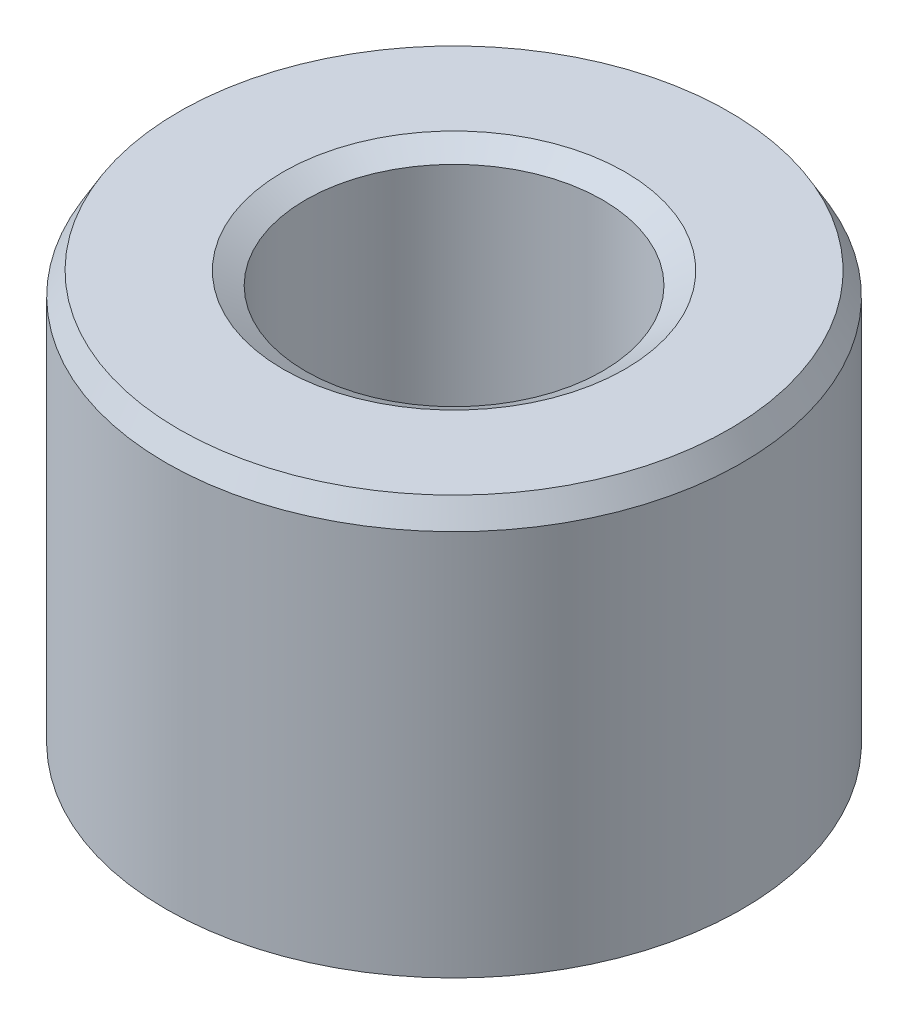
ISO-10303-21;
HEADER;
FILE_DESCRIPTION(('STEP AP214'),'2;1');
FILE_NAME('part.step','',(''),(''),'','','');
FILE_SCHEMA(('AUTOMOTIVE_DESIGN { 1 0 10303 214 1 1 1 1 }'));
ENDSEC;
DATA;
#1=APPLICATION_CONTEXT('core data for automotive mechanical design processes');
#2=APPLICATION_PROTOCOL_DEFINITION('international standard','automotive_design',2000,#1);
#3=PRODUCT_CONTEXT('',#1,'mechanical');
#4=PRODUCT('Part','Part','',(#3));
#5=PRODUCT_RELATED_PRODUCT_CATEGORY('part','',(#4));
#6=PRODUCT_DEFINITION_FORMATION('','',#4);
#7=PRODUCT_DEFINITION_CONTEXT('part definition',#1,'design');
#8=PRODUCT_DEFINITION('design','',#6,#7);
#9=PRODUCT_DEFINITION_SHAPE('','',#8);
#10=(LENGTH_UNIT() NAMED_UNIT(*) SI_UNIT(.MILLI.,.METRE.));
#11=(NAMED_UNIT(*) PLANE_ANGLE_UNIT() SI_UNIT($,.RADIAN.));
#12=(NAMED_UNIT(*) SI_UNIT($,.STERADIAN.) SOLID_ANGLE_UNIT());
#13=UNCERTAINTY_MEASURE_WITH_UNIT(LENGTH_MEASURE(1.E-05),#10,'distance_accuracy_value','');
#14=(GEOMETRIC_REPRESENTATION_CONTEXT(3) GLOBAL_UNCERTAINTY_ASSIGNED_CONTEXT((#13)) GLOBAL_UNIT_ASSIGNED_CONTEXT((#10,
#11,#12)) REPRESENTATION_CONTEXT('',''));
#15=CARTESIAN_POINT('',(0.,0.,0.));
#16=DIRECTION('',(0.,0.,1.));
#17=DIRECTION('',(1.,0.,0.));
#18=AXIS2_PLACEMENT_3D('',#15,#16,#17);
#19=CARTESIAN_POINT('',(0.,54.9305365331568,0.));
#20=DIRECTION('',(0.,-1.,0.));
#21=DIRECTION('',(0.,0.,-1.));
#22=AXIS2_PLACEMENT_3D('',#19,#20,#21);
#23=CYLINDRICAL_SURFACE('',#22,37.5);
#24=CARTESIAN_POINT('',(0.,1.68971337291047,0.));
#25=DIRECTION('',(0.,1.,0.));
#26=DIRECTION('',(0.,0.,1.));
#27=AXIS2_PLACEMENT_3D('',#24,#25,#26);
#28=CIRCLE('',#27,37.5);
#29=CARTESIAN_POINT('',(0.,1.68971337291047,37.5));
#30=VERTEX_POINT('',#29);
#31=EDGE_CURVE('E10',#30,#30,#28,.T.);
#32=ORIENTED_EDGE('',*,*,#31,.T.);
#33=EDGE_LOOP('',(#32));
#34=FACE_BOUND('',#33,.T.);
#35=CARTESIAN_POINT('',(0.,52.0038671210472,0.));
#36=DIRECTION('',(0.,1.,0.));
#37=DIRECTION('',(0.,0.,1.));
#38=AXIS2_PLACEMENT_3D('',#35,#36,#37);
#39=CIRCLE('',#38,37.5);
#40=CARTESIAN_POINT('',(0.,52.0038671210472,37.5));
#41=VERTEX_POINT('',#40);
#42=EDGE_CURVE('E50',#41,#41,#39,.F.);
#43=ORIENTED_EDGE('',*,*,#42,.T.);
#44=EDGE_LOOP('',(#43));
#45=FACE_BOUND('',#44,.T.);
#46=ADVANCED_FACE('F39',(#34,#45),#23,.T.);
#47=CARTESIAN_POINT('',(0.,54.9305365331568,0.));
#48=DIRECTION('',(0.,1.,0.));
#49=DIRECTION('',(0.,0.,1.));
#50=AXIS2_PLACEMENT_3D('',#47,#48,#49);
#51=PLANE('',#50);
#52=CARTESIAN_POINT('',(0.,54.9305365331568,0.));
#53=DIRECTION('',(0.,1.,0.));
#54=DIRECTION('',(0.,0.,1.));
#55=AXIS2_PLACEMENT_3D('',#52,#53,#54);
#56=CIRCLE('',#55,22.2498414124076);
#57=CARTESIAN_POINT('',(0.,54.9305365331568,22.2498414124076));
#58=VERTEX_POINT('',#57);
#59=EDGE_CURVE('E58',#58,#58,#56,.F.);
#60=ORIENTED_EDGE('',*,*,#59,.T.);
#61=EDGE_LOOP('',(#60));
#62=FACE_BOUND('',#61,.T.);
#63=CARTESIAN_POINT('',(0.,54.9305365331568,0.));
#64=DIRECTION('',(0.,1.,0.));
#65=DIRECTION('',(0.,0.,1.));
#66=AXIS2_PLACEMENT_3D('',#63,#64,#65);
#67=CIRCLE('',#66,35.8102866270895);
#68=CARTESIAN_POINT('',(0.,54.9305365331568,35.8102866270895));
#69=VERTEX_POINT('',#68);
#70=EDGE_CURVE('E61',#69,#69,#67,.T.);
#71=ORIENTED_EDGE('',*,*,#70,.T.);
#72=EDGE_LOOP('',(#71));
#73=FACE_BOUND('',#72,.T.);
#74=ADVANCED_FACE('F88',(#62,#73),#51,.T.);
#75=CARTESIAN_POINT('',(0.,0.,0.));
#76=DIRECTION('',(0.,1.,0.));
#77=DIRECTION('',(0.,0.,1.));
#78=AXIS2_PLACEMENT_3D('',#75,#76,#77);
#79=PLANE('',#78);
#80=CARTESIAN_POINT('',(0.,0.,0.));
#81=DIRECTION('',(0.,1.,0.));
#82=DIRECTION('',(0.,0.,1.));
#83=AXIS2_PLACEMENT_3D('',#80,#81,#82);
#84=CIRCLE('',#83,21.0128853732086);
#85=CARTESIAN_POINT('',(0.,0.,21.0128853732086));
#86=VERTEX_POINT('',#85);
#87=EDGE_CURVE('E51',#86,#86,#84,.T.);
#88=ORIENTED_EDGE('',*,*,#87,.T.);
#89=EDGE_LOOP('',(#88));
#90=FACE_BOUND('',#89,.T.);
#91=CARTESIAN_POINT('',(0.,0.,0.));
#92=DIRECTION('',(0.,1.,0.));
#93=DIRECTION('',(0.,0.,1.));
#94=AXIS2_PLACEMENT_3D('',#91,#92,#93);
#95=CIRCLE('',#94,34.5733305878905);
#96=CARTESIAN_POINT('',(0.,0.,34.5733305878905));
#97=VERTEX_POINT('',#96);
#98=EDGE_CURVE('E54',#97,#97,#95,.F.);
#99=ORIENTED_EDGE('',*,*,#98,.T.);
#100=EDGE_LOOP('',(#99));
#101=FACE_BOUND('',#100,.T.);
#102=ADVANCED_FACE('F83',(#90,#101),#79,.F.);
#103=CARTESIAN_POINT('',(0.,54.9305365331568,0.));
#104=DIRECTION('',(0.,-1.,0.));
#105=DIRECTION('',(0.,0.,-1.));
#106=AXIS2_PLACEMENT_3D('',#103,#104,#105);
#107=CYLINDRICAL_SURFACE('',#106,19.3231720002981);
#108=CARTESIAN_POINT('',(0.,53.2408231602463,0.));
#109=DIRECTION('',(0.,1.,0.));
#110=DIRECTION('',(0.,0.,1.));
#111=AXIS2_PLACEMENT_3D('',#108,#109,#110);
#112=CIRCLE('',#111,19.3231720002981);
#113=CARTESIAN_POINT('',(0.,53.2408231602463,19.3231720002981));
#114=VERTEX_POINT('',#113);
#115=EDGE_CURVE('E67',#114,#114,#112,.T.);
#116=ORIENTED_EDGE('',*,*,#115,.T.);
#117=EDGE_LOOP('',(#116));
#118=FACE_BOUND('',#117,.T.);
#119=CARTESIAN_POINT('',(0.,2.92666941210953,0.));
#120=DIRECTION('',(0.,1.,0.));
#121=DIRECTION('',(0.,0.,1.));
#122=AXIS2_PLACEMENT_3D('',#119,#120,#121);
#123=CIRCLE('',#122,19.3231720002981);
#124=CARTESIAN_POINT('',(0.,2.92666941210953,19.3231720002981));
#125=VERTEX_POINT('',#124);
#126=EDGE_CURVE('E69',#125,#125,#123,.F.);
#127=ORIENTED_EDGE('',*,*,#126,.T.);
#128=EDGE_LOOP('',(#127));
#129=FACE_BOUND('',#128,.T.);
#130=ADVANCED_FACE('F71',(#118,#129),#107,.F.);
#131=CARTESIAN_POINT('',(0.,53.2408231602463,0.));
#132=DIRECTION('',(0.,1.,0.));
#133=DIRECTION('',(0.,0.,1.));
#134=AXIS2_PLACEMENT_3D('',#131,#132,#133);
#135=CONICAL_SURFACE('',#134,19.3231720002981,1.0471975511966);
#136=ORIENTED_EDGE('',*,*,#59,.F.);
#137=EDGE_LOOP('',(#136));
#138=FACE_BOUND('',#137,.T.);
#139=ORIENTED_EDGE('',*,*,#115,.F.);
#140=EDGE_LOOP('',(#139));
#141=FACE_BOUND('',#140,.T.);
#142=ADVANCED_FACE('F77',(#138,#141),#135,.F.);
#143=CARTESIAN_POINT('',(0.,0.,0.));
#144=DIRECTION('',(0.,-1.,0.));
#145=DIRECTION('',(0.,0.,-1.));
#146=AXIS2_PLACEMENT_3D('',#143,#144,#145);
#147=CONICAL_SURFACE('',#146,21.0128853732086,0.523598775598294);
#148=ORIENTED_EDGE('',*,*,#126,.F.);
#149=EDGE_LOOP('',(#148));
#150=FACE_BOUND('',#149,.T.);
#151=ORIENTED_EDGE('',*,*,#87,.F.);
#152=EDGE_LOOP('',(#151));
#153=FACE_BOUND('',#152,.T.);
#154=ADVANCED_FACE('F73',(#150,#153),#147,.F.);
#155=CARTESIAN_POINT('',(0.,1.68971337291047,0.));
#156=DIRECTION('',(0.,1.,0.));
#157=DIRECTION('',(0.,0.,1.));
#158=AXIS2_PLACEMENT_3D('',#155,#156,#157);
#159=CONICAL_SURFACE('',#158,37.5,1.0471975511966);
#160=ORIENTED_EDGE('',*,*,#98,.F.);
#161=EDGE_LOOP('',(#160));
#162=FACE_BOUND('',#161,.T.);
#163=ORIENTED_EDGE('',*,*,#31,.F.);
#164=EDGE_LOOP('',(#163));
#165=FACE_BOUND('',#164,.T.);
#166=ADVANCED_FACE('F76',(#162,#165),#159,.T.);
#167=CARTESIAN_POINT('',(0.,54.9305365331568,0.));
#168=DIRECTION('',(0.,-1.,0.));
#169=DIRECTION('',(0.,0.,-1.));
#170=AXIS2_PLACEMENT_3D('',#167,#168,#169);
#171=CONICAL_SURFACE('',#170,35.8102866270895,0.5235987755983);
#172=ORIENTED_EDGE('',*,*,#42,.F.);
#173=EDGE_LOOP('',(#172));
#174=FACE_BOUND('',#173,.T.);
#175=ORIENTED_EDGE('',*,*,#70,.F.);
#176=EDGE_LOOP('',(#175));
#177=FACE_BOUND('',#176,.T.);
#178=ADVANCED_FACE('F45',(#174,#177),#171,.T.);
#179=CLOSED_SHELL('',(#46,#74,#102,#130,#142,#154,#166,#178));
#180=MANIFOLD_SOLID_BREP('B2',#179);
#181=ADVANCED_BREP_SHAPE_REPRESENTATION('',(#18,#180),#14);
#182=SHAPE_DEFINITION_REPRESENTATION(#9,#181);
ENDSEC;
END-ISO-10303-21;
